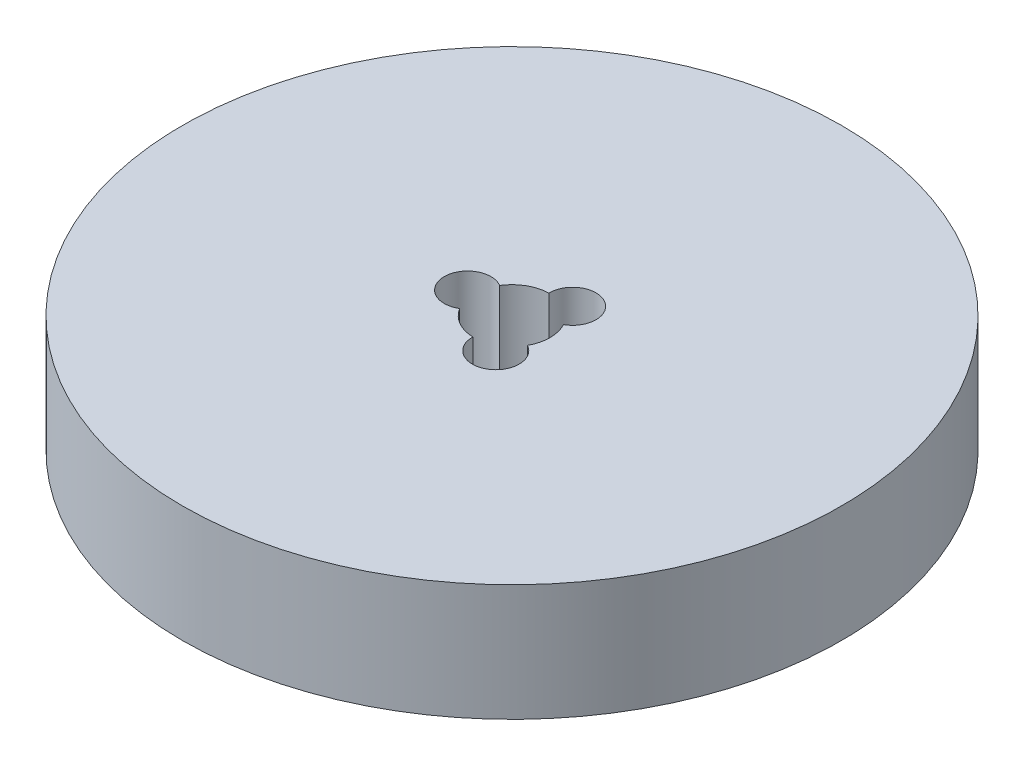
ISO-10303-21;
HEADER;
FILE_DESCRIPTION(('STEP AP214'),'2;1');
FILE_NAME('part.step','',(''),(''),'','','');
FILE_SCHEMA(('AUTOMOTIVE_DESIGN { 1 0 10303 214 1 1 1 1 }'));
ENDSEC;
DATA;
#1=APPLICATION_CONTEXT('core data for automotive mechanical design processes');
#2=APPLICATION_PROTOCOL_DEFINITION('international standard','automotive_design',2000,#1);
#3=PRODUCT_CONTEXT('',#1,'mechanical');
#4=PRODUCT('Part','Part','',(#3));
#5=PRODUCT_RELATED_PRODUCT_CATEGORY('part','',(#4));
#6=PRODUCT_DEFINITION_FORMATION('','',#4);
#7=PRODUCT_DEFINITION_CONTEXT('part definition',#1,'design');
#8=PRODUCT_DEFINITION('design','',#6,#7);
#9=PRODUCT_DEFINITION_SHAPE('','',#8);
#10=(LENGTH_UNIT() NAMED_UNIT(*) SI_UNIT(.MILLI.,.METRE.));
#11=(NAMED_UNIT(*) PLANE_ANGLE_UNIT() SI_UNIT($,.RADIAN.));
#12=(NAMED_UNIT(*) SI_UNIT($,.STERADIAN.) SOLID_ANGLE_UNIT());
#13=UNCERTAINTY_MEASURE_WITH_UNIT(LENGTH_MEASURE(1.E-05),#10,'distance_accuracy_value','');
#14=(GEOMETRIC_REPRESENTATION_CONTEXT(3) GLOBAL_UNCERTAINTY_ASSIGNED_CONTEXT((#13)) GLOBAL_UNIT_ASSIGNED_CONTEXT((#10,
#11,#12)) REPRESENTATION_CONTEXT('',''));
#15=CARTESIAN_POINT('',(0.,0.,0.));
#16=DIRECTION('',(0.,0.,1.));
#17=DIRECTION('',(1.,0.,0.));
#18=AXIS2_PLACEMENT_3D('',#15,#16,#17);
#19=CARTESIAN_POINT('',(0.,23.,0.));
#20=DIRECTION('',(0.,-1.,0.));
#21=DIRECTION('',(0.,0.,-1.));
#22=AXIS2_PLACEMENT_3D('',#19,#20,#21);
#23=CYLINDRICAL_SURFACE('',#22,65.);
#24=CARTESIAN_POINT('',(0.,23.,0.));
#25=DIRECTION('',(0.,1.,0.));
#26=DIRECTION('',(0.,0.,1.));
#27=AXIS2_PLACEMENT_3D('',#24,#25,#26);
#28=CIRCLE('',#27,65.);
#29=CARTESIAN_POINT('',(0.,23.,65.));
#30=VERTEX_POINT('',#29);
#31=EDGE_CURVE('E126',#30,#30,#28,.T.);
#32=ORIENTED_EDGE('',*,*,#31,.F.);
#33=EDGE_LOOP('',(#32));
#34=FACE_BOUND('',#33,.T.);
#35=CARTESIAN_POINT('',(0.,0.,0.));
#36=DIRECTION('',(0.,1.,0.));
#37=DIRECTION('',(0.,0.,1.));
#38=AXIS2_PLACEMENT_3D('',#35,#36,#37);
#39=CIRCLE('',#38,65.);
#40=CARTESIAN_POINT('',(0.,0.,65.));
#41=VERTEX_POINT('',#40);
#42=EDGE_CURVE('E124',#41,#41,#39,.T.);
#43=ORIENTED_EDGE('',*,*,#42,.T.);
#44=EDGE_LOOP('',(#43));
#45=FACE_BOUND('',#44,.T.);
#46=ADVANCED_FACE('F39',(#34,#45),#23,.T.);
#47=CARTESIAN_POINT('',(0.,23.,0.));
#48=DIRECTION('',(0.,1.,0.));
#49=DIRECTION('',(0.,0.,1.));
#50=AXIS2_PLACEMENT_3D('',#47,#48,#49);
#51=PLANE('',#50);
#52=CARTESIAN_POINT('',(4.37857733900535,23.,7.58391841602692));
#53=DIRECTION('',(0.,1.,0.));
#54=DIRECTION('',(0.866025403784436,0.,-0.500000000000004));
#55=AXIS2_PLACEMENT_3D('',#52,#53,#54);
#56=CIRCLE('',#55,4.60651601555337);
#57=CARTESIAN_POINT('',(-0.227110276824536,23.,7.49656060618206));
#58=VERTEX_POINT('',#57);
#59=CARTESIAN_POINT('',(6.60576706437563,23.,3.5515970339004));
#60=VERTEX_POINT('',#59);
#61=EDGE_CURVE('E147',#58,#60,#56,.T.);
#62=ORIENTED_EDGE('',*,*,#61,.F.);
#63=CARTESIAN_POINT('',(0.,23.,0.));
#64=DIRECTION('',(0.,1.,0.));
#65=DIRECTION('',(0.,0.,1.));
#66=AXIS2_PLACEMENT_3D('',#63,#64,#65);
#67=CIRCLE('',#66,7.5);
#68=CARTESIAN_POINT('',(-6.37865678755105,23.,3.94496357228162));
#69=VERTEX_POINT('',#68);
#70=EDGE_CURVE('E118',#69,#58,#67,.T.);
#71=ORIENTED_EDGE('',*,*,#70,.F.);
#72=CARTESIAN_POINT('',(-8.75715467801063,23.,0.));
#73=DIRECTION('',(0.,1.,0.));
#74=DIRECTION('',(0.,0.,1.));
#75=AXIS2_PLACEMENT_3D('',#72,#73,#74);
#76=CIRCLE('',#75,4.60651601555337);
#77=CARTESIAN_POINT('',(-6.37865678755105,23.,-3.94496357228162));
#78=VERTEX_POINT('',#77);
#79=EDGE_CURVE('E113',#78,#69,#76,.T.);
#80=ORIENTED_EDGE('',*,*,#79,.F.);
#81=CARTESIAN_POINT('',(-0.227110276824641,23.,-7.49656060618205));
#82=VERTEX_POINT('',#81);
#83=EDGE_CURVE('E106',#82,#78,#67,.T.);
#84=ORIENTED_EDGE('',*,*,#83,.F.);
#85=CARTESIAN_POINT('',(4.37857733900524,23.,-7.58391841602698));
#86=DIRECTION('',(0.,1.,0.));
#87=DIRECTION('',(-0.866025403784443,0.,-0.499999999999992));
#88=AXIS2_PLACEMENT_3D('',#85,#86,#87);
#89=CIRCLE('',#88,4.60651601555337);
#90=CARTESIAN_POINT('',(6.60576706437558,23.,-3.55159703390049));
#91=VERTEX_POINT('',#90);
#92=EDGE_CURVE('E90',#91,#82,#89,.T.);
#93=ORIENTED_EDGE('',*,*,#92,.F.);
#94=EDGE_CURVE('E116',#60,#91,#67,.T.);
#95=ORIENTED_EDGE('',*,*,#94,.F.);
#96=EDGE_LOOP('',(#62,#71,#80,#84,#93,#95));
#97=FACE_BOUND('',#96,.T.);
#98=ORIENTED_EDGE('',*,*,#31,.T.);
#99=EDGE_LOOP('',(#98));
#100=FACE_BOUND('',#99,.T.);
#101=ADVANCED_FACE('F115',(#97,#100),#51,.T.);
#102=CARTESIAN_POINT('',(0.,0.,0.));
#103=DIRECTION('',(0.,1.,0.));
#104=DIRECTION('',(0.,0.,1.));
#105=AXIS2_PLACEMENT_3D('',#102,#103,#104);
#106=PLANE('',#105);
#107=CARTESIAN_POINT('',(0.,0.,0.));
#108=DIRECTION('',(0.,1.,0.));
#109=DIRECTION('',(0.,0.,1.));
#110=AXIS2_PLACEMENT_3D('',#107,#108,#109);
#111=CIRCLE('',#110,7.5);
#112=CARTESIAN_POINT('',(0.,0.,7.5));
#113=VERTEX_POINT('',#112);
#114=EDGE_CURVE('E120',#113,#113,#111,.T.);
#115=ORIENTED_EDGE('',*,*,#114,.T.);
#116=EDGE_LOOP('',(#115));
#117=FACE_BOUND('',#116,.T.);
#118=ORIENTED_EDGE('',*,*,#42,.F.);
#119=EDGE_LOOP('',(#118));
#120=FACE_BOUND('',#119,.T.);
#121=ADVANCED_FACE('F164',(#117,#120),#106,.F.);
#122=CARTESIAN_POINT('',(0.,23.,0.));
#123=DIRECTION('',(0.,-1.,0.));
#124=DIRECTION('',(0.,0.,-1.));
#125=AXIS2_PLACEMENT_3D('',#122,#123,#124);
#126=CYLINDRICAL_SURFACE('',#125,7.5);
#127=DIRECTION('',(0.,1.,0.));
#128=VECTOR('',#127,1.);
#129=CARTESIAN_POINT('',(-0.227110276824536,14.1980355936469,7.49656060618206));
#130=LINE('',#129,#128);
#131=CARTESIAN_POINT('',(-0.227110276824536,5.39607118729386,7.49656060618206));
#132=VERTEX_POINT('',#131);
#133=EDGE_CURVE('E11',#132,#58,#130,.T.);
#134=ORIENTED_EDGE('',*,*,#133,.F.);
#135=CARTESIAN_POINT('',(0.,5.39607118729386,0.));
#136=DIRECTION('',(0.,1.,0.));
#137=DIRECTION('',(0.,0.,1.));
#138=AXIS2_PLACEMENT_3D('',#135,#136,#137);
#139=CIRCLE('',#138,7.5);
#140=CARTESIAN_POINT('',(6.60576706437563,5.39607118729386,3.5515970339004));
#141=VERTEX_POINT('',#140);
#142=EDGE_CURVE('E144',#132,#141,#139,.T.);
#143=ORIENTED_EDGE('',*,*,#142,.T.);
#144=DIRECTION('',(0.,1.,0.));
#145=VECTOR('',#144,1.);
#146=CARTESIAN_POINT('',(6.60576706437563,14.1980355936469,3.5515970339004));
#147=LINE('',#146,#145);
#148=EDGE_CURVE('E46',#60,#141,#147,.F.);
#149=ORIENTED_EDGE('',*,*,#148,.F.);
#150=ORIENTED_EDGE('',*,*,#94,.T.);
#151=DIRECTION('',(0.,1.,0.));
#152=VECTOR('',#151,1.);
#153=CARTESIAN_POINT('',(6.60576706437558,14.1980355936469,-3.55159703390049));
#154=LINE('',#153,#152);
#155=CARTESIAN_POINT('',(6.60576706437558,5.39607118729386,-3.55159703390049));
#156=VERTEX_POINT('',#155);
#157=EDGE_CURVE('E92',#156,#91,#154,.T.);
#158=ORIENTED_EDGE('',*,*,#157,.F.);
#159=CARTESIAN_POINT('',(0.,5.39607118729386,0.));
#160=DIRECTION('',(0.,1.,0.));
#161=DIRECTION('',(0.,0.,1.));
#162=AXIS2_PLACEMENT_3D('',#159,#160,#161);
#163=CIRCLE('',#162,7.5);
#164=CARTESIAN_POINT('',(-0.227110276824641,5.39607118729386,-7.49656060618205));
#165=VERTEX_POINT('',#164);
#166=EDGE_CURVE('E107',#156,#165,#163,.T.);
#167=ORIENTED_EDGE('',*,*,#166,.T.);
#168=DIRECTION('',(0.,1.,0.));
#169=VECTOR('',#168,1.);
#170=CARTESIAN_POINT('',(-0.227110276824641,14.1980355936469,-7.49656060618205));
#171=LINE('',#170,#169);
#172=EDGE_CURVE('E95',#82,#165,#171,.F.);
#173=ORIENTED_EDGE('',*,*,#172,.F.);
#174=ORIENTED_EDGE('',*,*,#83,.T.);
#175=DIRECTION('',(0.,1.,0.));
#176=VECTOR('',#175,1.);
#177=CARTESIAN_POINT('',(-6.37865678755105,14.1980355936469,-3.94496357228162));
#178=LINE('',#177,#176);
#179=CARTESIAN_POINT('',(-6.37865678755105,5.39607118729386,-3.94496357228162));
#180=VERTEX_POINT('',#179);
#181=EDGE_CURVE('E143',#180,#78,#178,.T.);
#182=ORIENTED_EDGE('',*,*,#181,.F.);
#183=CARTESIAN_POINT('',(0.,5.39607118729386,0.));
#184=DIRECTION('',(0.,1.,0.));
#185=DIRECTION('',(0.,0.,1.));
#186=AXIS2_PLACEMENT_3D('',#183,#184,#185);
#187=CIRCLE('',#186,7.5);
#188=CARTESIAN_POINT('',(-6.37865678755105,5.39607118729386,3.94496357228162));
#189=VERTEX_POINT('',#188);
#190=EDGE_CURVE('E132',#180,#189,#187,.T.);
#191=ORIENTED_EDGE('',*,*,#190,.T.);
#192=DIRECTION('',(0.,1.,0.));
#193=VECTOR('',#192,1.);
#194=CARTESIAN_POINT('',(-6.37865678755105,14.1980355936469,3.94496357228162));
#195=LINE('',#194,#193);
#196=EDGE_CURVE('E137',#69,#189,#195,.F.);
#197=ORIENTED_EDGE('',*,*,#196,.F.);
#198=ORIENTED_EDGE('',*,*,#70,.T.);
#199=EDGE_LOOP('',(#134,#143,#149,#150,#158,#167,#173,#174,#182,#191,#197,#198));
#200=FACE_BOUND('',#199,.T.);
#201=ORIENTED_EDGE('',*,*,#114,.F.);
#202=EDGE_LOOP('',(#201));
#203=FACE_BOUND('',#202,.T.);
#204=ADVANCED_FACE('F103',(#200,#203),#126,.F.);
#205=CARTESIAN_POINT('',(-8.75715467801063,5.39607118729386,0.));
#206=DIRECTION('',(0.,1.,0.));
#207=DIRECTION('',(0.,0.,1.));
#208=AXIS2_PLACEMENT_3D('',#205,#206,#207);
#209=CYLINDRICAL_SURFACE('',#208,4.60651601555337);
#210=ORIENTED_EDGE('',*,*,#181,.T.);
#211=ORIENTED_EDGE('',*,*,#79,.T.);
#212=ORIENTED_EDGE('',*,*,#196,.T.);
#213=CARTESIAN_POINT('',(-8.75715467801063,5.39607118729386,0.));
#214=DIRECTION('',(0.,1.,0.));
#215=DIRECTION('',(0.,0.,1.));
#216=AXIS2_PLACEMENT_3D('',#213,#214,#215);
#217=CIRCLE('',#216,4.60651601555337);
#218=EDGE_CURVE('E121',#180,#189,#217,.T.);
#219=ORIENTED_EDGE('',*,*,#218,.F.);
#220=EDGE_LOOP('',(#210,#211,#212,#219));
#221=FACE_BOUND('',#220,.T.);
#222=ADVANCED_FACE('F174',(#221),#209,.F.);
#223=CARTESIAN_POINT('',(-8.75715467801063,5.39607118729386,0.));
#224=DIRECTION('',(0.,1.,0.));
#225=DIRECTION('',(0.,0.,1.));
#226=AXIS2_PLACEMENT_3D('',#223,#224,#225);
#227=PLANE('',#226);
#228=ORIENTED_EDGE('',*,*,#218,.T.);
#229=ORIENTED_EDGE('',*,*,#190,.F.);
#230=EDGE_LOOP('',(#228,#229));
#231=FACE_BOUND('',#230,.T.);
#232=ADVANCED_FACE('F177',(#231),#227,.T.);
#233=CARTESIAN_POINT('',(4.37857733900524,5.39607118729386,-7.58391841602698));
#234=DIRECTION('',(0.,1.,0.));
#235=DIRECTION('',(0.,0.,1.));
#236=AXIS2_PLACEMENT_3D('',#233,#234,#235);
#237=CYLINDRICAL_SURFACE('',#236,4.60651601555337);
#238=ORIENTED_EDGE('',*,*,#157,.T.);
#239=ORIENTED_EDGE('',*,*,#92,.T.);
#240=ORIENTED_EDGE('',*,*,#172,.T.);
#241=CARTESIAN_POINT('',(4.37857733900524,5.39607118729386,-7.58391841602698));
#242=DIRECTION('',(0.,1.,0.));
#243=DIRECTION('',(-0.866025403784443,0.,-0.499999999999992));
#244=AXIS2_PLACEMENT_3D('',#241,#242,#243);
#245=CIRCLE('',#244,4.60651601555337);
#246=EDGE_CURVE('E56',#156,#165,#245,.T.);
#247=ORIENTED_EDGE('',*,*,#246,.F.);
#248=EDGE_LOOP('',(#238,#239,#240,#247));
#249=FACE_BOUND('',#248,.T.);
#250=ADVANCED_FACE('F93',(#249),#237,.F.);
#251=CARTESIAN_POINT('',(4.37857733900524,5.39607118729386,-7.58391841602698));
#252=DIRECTION('',(0.,1.,0.));
#253=DIRECTION('',(-0.866025403784443,0.,-0.499999999999992));
#254=AXIS2_PLACEMENT_3D('',#251,#252,#253);
#255=PLANE('',#254);
#256=ORIENTED_EDGE('',*,*,#246,.T.);
#257=ORIENTED_EDGE('',*,*,#166,.F.);
#258=EDGE_LOOP('',(#256,#257));
#259=FACE_BOUND('',#258,.T.);
#260=ADVANCED_FACE('F160',(#259),#255,.T.);
#261=CARTESIAN_POINT('',(4.37857733900535,5.39607118729386,7.58391841602692));
#262=DIRECTION('',(0.,1.,0.));
#263=DIRECTION('',(0.,0.,1.));
#264=AXIS2_PLACEMENT_3D('',#261,#262,#263);
#265=CYLINDRICAL_SURFACE('',#264,4.60651601555337);
#266=ORIENTED_EDGE('',*,*,#133,.T.);
#267=ORIENTED_EDGE('',*,*,#61,.T.);
#268=ORIENTED_EDGE('',*,*,#148,.T.);
#269=CARTESIAN_POINT('',(4.37857733900535,5.39607118729386,7.58391841602692));
#270=DIRECTION('',(0.,1.,0.));
#271=DIRECTION('',(0.866025403784436,0.,-0.500000000000004));
#272=AXIS2_PLACEMENT_3D('',#269,#270,#271);
#273=CIRCLE('',#272,4.60651601555337);
#274=EDGE_CURVE('E55',#132,#141,#273,.T.);
#275=ORIENTED_EDGE('',*,*,#274,.F.);
#276=EDGE_LOOP('',(#266,#267,#268,#275));
#277=FACE_BOUND('',#276,.T.);
#278=ADVANCED_FACE('F149',(#277),#265,.F.);
#279=CARTESIAN_POINT('',(4.37857733900535,5.39607118729386,7.58391841602692));
#280=DIRECTION('',(0.,1.,0.));
#281=DIRECTION('',(0.866025403784436,0.,-0.500000000000004));
#282=AXIS2_PLACEMENT_3D('',#279,#280,#281);
#283=PLANE('',#282);
#284=ORIENTED_EDGE('',*,*,#274,.T.);
#285=ORIENTED_EDGE('',*,*,#142,.F.);
#286=EDGE_LOOP('',(#284,#285));
#287=FACE_BOUND('',#286,.T.);
#288=ADVANCED_FACE('F151',(#287),#283,.T.);
#289=CLOSED_SHELL('',(#46,#101,#121,#204,#222,#232,#250,#260,#278,#288));
#290=MANIFOLD_SOLID_BREP('B2',#289);
#291=ADVANCED_BREP_SHAPE_REPRESENTATION('',(#18,#290),#14);
#292=SHAPE_DEFINITION_REPRESENTATION(#9,#291);
ENDSEC;
END-ISO-10303-21;
